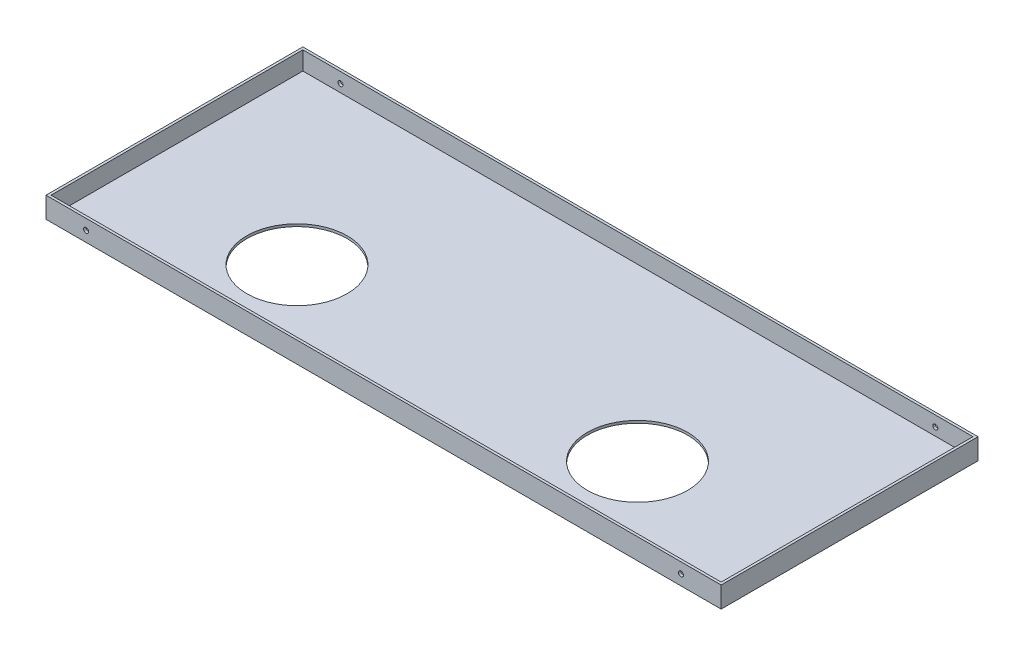
ISO-10303-21;
HEADER;
FILE_DESCRIPTION(('STEP AP214'),'2;1');
FILE_NAME('part.step','',(''),(''),'','','');
FILE_SCHEMA(('AUTOMOTIVE_DESIGN { 1 0 10303 214 1 1 1 1 }'));
ENDSEC;
DATA;
#1=APPLICATION_CONTEXT('core data for automotive mechanical design processes');
#2=APPLICATION_PROTOCOL_DEFINITION('international standard','automotive_design',2000,#1);
#3=PRODUCT_CONTEXT('',#1,'mechanical');
#4=PRODUCT('Part','Part','',(#3));
#5=PRODUCT_RELATED_PRODUCT_CATEGORY('part','',(#4));
#6=PRODUCT_DEFINITION_FORMATION('','',#4);
#7=PRODUCT_DEFINITION_CONTEXT('part definition',#1,'design');
#8=PRODUCT_DEFINITION('design','',#6,#7);
#9=PRODUCT_DEFINITION_SHAPE('','',#8);
#10=(LENGTH_UNIT() NAMED_UNIT(*) SI_UNIT(.MILLI.,.METRE.));
#11=(NAMED_UNIT(*) PLANE_ANGLE_UNIT() SI_UNIT($,.RADIAN.));
#12=(NAMED_UNIT(*) SI_UNIT($,.STERADIAN.) SOLID_ANGLE_UNIT());
#13=UNCERTAINTY_MEASURE_WITH_UNIT(LENGTH_MEASURE(1.E-05),#10,'distance_accuracy_value','');
#14=(GEOMETRIC_REPRESENTATION_CONTEXT(3) GLOBAL_UNCERTAINTY_ASSIGNED_CONTEXT((#13)) GLOBAL_UNIT_ASSIGNED_CONTEXT((#10,
#11,#12)) REPRESENTATION_CONTEXT('',''));
#15=CARTESIAN_POINT('',(0.,0.,0.));
#16=DIRECTION('',(0.,0.,1.));
#17=DIRECTION('',(1.,0.,0.));
#18=AXIS2_PLACEMENT_3D('',#15,#16,#17);
#19=CARTESIAN_POINT('',(807.,25.,0.));
#20=DIRECTION('',(0.,0.,1.));
#21=DIRECTION('',(1.,0.,0.));
#22=AXIS2_PLACEMENT_3D('',#19,#20,#21);
#23=PLANE('',#22);
#24=CARTESIAN_POINT('',(759.,12.5,0.));
#25=DIRECTION('',(0.,0.,1.));
#26=DIRECTION('',(1.,0.,0.));
#27=AXIS2_PLACEMENT_3D('',#24,#25,#26);
#28=CIRCLE('',#27,3.00000000000005);
#29=CARTESIAN_POINT('',(762.,12.5,0.));
#30=VERTEX_POINT('',#29);
#31=EDGE_CURVE('E204',#30,#30,#28,.T.);
#32=ORIENTED_EDGE('',*,*,#31,.T.);
#33=EDGE_LOOP('',(#32));
#34=FACE_BOUND('',#33,.T.);
#35=CARTESIAN_POINT('',(48.,12.5,0.));
#36=DIRECTION('',(0.,0.,1.));
#37=DIRECTION('',(1.,0.,0.));
#38=AXIS2_PLACEMENT_3D('',#35,#36,#37);
#39=CIRCLE('',#38,3.);
#40=CARTESIAN_POINT('',(51.,12.5,0.));
#41=VERTEX_POINT('',#40);
#42=EDGE_CURVE('E234',#41,#41,#39,.T.);
#43=ORIENTED_EDGE('',*,*,#42,.T.);
#44=EDGE_LOOP('',(#43));
#45=FACE_BOUND('',#44,.T.);
#46=DIRECTION('',(-1.,0.,0.));
#47=VECTOR('',#46,1.);
#48=CARTESIAN_POINT('',(807.,0.,0.));
#49=LINE('',#48,#47);
#50=CARTESIAN_POINT('',(807.,0.,0.));
#51=VERTEX_POINT('',#50);
#52=CARTESIAN_POINT('',(0.,0.,0.));
#53=VERTEX_POINT('',#52);
#54=EDGE_CURVE('E163',#51,#53,#49,.T.);
#55=ORIENTED_EDGE('',*,*,#54,.T.);
#56=DIRECTION('',(0.,-1.,0.));
#57=VECTOR('',#56,1.);
#58=CARTESIAN_POINT('',(0.,25.,0.));
#59=LINE('',#58,#57);
#60=CARTESIAN_POINT('',(0.,25.,0.));
#61=VERTEX_POINT('',#60);
#62=EDGE_CURVE('E11',#61,#53,#59,.T.);
#63=ORIENTED_EDGE('',*,*,#62,.F.);
#64=DIRECTION('',(-1.,0.,0.));
#65=VECTOR('',#64,1.);
#66=CARTESIAN_POINT('',(807.,25.,0.));
#67=LINE('',#66,#65);
#68=CARTESIAN_POINT('',(807.,25.,0.));
#69=VERTEX_POINT('',#68);
#70=EDGE_CURVE('E169',#69,#61,#67,.T.);
#71=ORIENTED_EDGE('',*,*,#70,.F.);
#72=DIRECTION('',(0.,-1.,0.));
#73=VECTOR('',#72,1.);
#74=CARTESIAN_POINT('',(807.,25.,0.));
#75=LINE('',#74,#73);
#76=EDGE_CURVE('E179',#69,#51,#75,.T.);
#77=ORIENTED_EDGE('',*,*,#76,.T.);
#78=EDGE_LOOP('',(#55,#63,#71,#77));
#79=FACE_BOUND('',#78,.T.);
#80=ADVANCED_FACE('F39',(#34,#45,#79),#23,.F.);
#81=CARTESIAN_POINT('',(0.,25.,0.));
#82=DIRECTION('',(1.,0.,0.));
#83=DIRECTION('',(0.,0.,-1.));
#84=AXIS2_PLACEMENT_3D('',#81,#82,#83);
#85=PLANE('',#84);
#86=DIRECTION('',(0.,0.,1.));
#87=VECTOR('',#86,1.);
#88=CARTESIAN_POINT('',(0.,0.,0.));
#89=LINE('',#88,#87);
#90=CARTESIAN_POINT('',(0.,0.,307.));
#91=VERTEX_POINT('',#90);
#92=EDGE_CURVE('E183',#53,#91,#89,.T.);
#93=ORIENTED_EDGE('',*,*,#92,.T.);
#94=DIRECTION('',(0.,-1.,0.));
#95=VECTOR('',#94,1.);
#96=CARTESIAN_POINT('',(0.,25.,307.));
#97=LINE('',#96,#95);
#98=CARTESIAN_POINT('',(0.,25.,307.));
#99=VERTEX_POINT('',#98);
#100=EDGE_CURVE('E48',#99,#91,#97,.T.);
#101=ORIENTED_EDGE('',*,*,#100,.F.);
#102=DIRECTION('',(0.,0.,1.));
#103=VECTOR('',#102,1.);
#104=CARTESIAN_POINT('',(0.,25.,0.));
#105=LINE('',#104,#103);
#106=EDGE_CURVE('E93',#61,#99,#105,.T.);
#107=ORIENTED_EDGE('',*,*,#106,.F.);
#108=ORIENTED_EDGE('',*,*,#62,.T.);
#109=EDGE_LOOP('',(#93,#101,#107,#108));
#110=FACE_BOUND('',#109,.T.);
#111=ADVANCED_FACE('F264',(#110),#85,.F.);
#112=CARTESIAN_POINT('',(0.,25.,307.));
#113=DIRECTION('',(0.,0.,-1.));
#114=DIRECTION('',(-1.,0.,0.));
#115=AXIS2_PLACEMENT_3D('',#112,#113,#114);
#116=PLANE('',#115);
#117=CARTESIAN_POINT('',(759.,12.5,307.));
#118=DIRECTION('',(0.,0.,1.));
#119=DIRECTION('',(1.,0.,0.));
#120=AXIS2_PLACEMENT_3D('',#117,#118,#119);
#121=CIRCLE('',#120,3.00000000000005);
#122=CARTESIAN_POINT('',(762.,12.5,307.));
#123=VERTEX_POINT('',#122);
#124=EDGE_CURVE('E230',#123,#123,#121,.T.);
#125=ORIENTED_EDGE('',*,*,#124,.F.);
#126=EDGE_LOOP('',(#125));
#127=FACE_BOUND('',#126,.T.);
#128=CARTESIAN_POINT('',(48.,12.5,307.));
#129=DIRECTION('',(0.,0.,1.));
#130=DIRECTION('',(1.,0.,0.));
#131=AXIS2_PLACEMENT_3D('',#128,#129,#130);
#132=CIRCLE('',#131,3.);
#133=CARTESIAN_POINT('',(51.,12.5,307.));
#134=VERTEX_POINT('',#133);
#135=EDGE_CURVE('E217',#134,#134,#132,.T.);
#136=ORIENTED_EDGE('',*,*,#135,.F.);
#137=EDGE_LOOP('',(#136));
#138=FACE_BOUND('',#137,.T.);
#139=DIRECTION('',(1.,0.,0.));
#140=VECTOR('',#139,1.);
#141=CARTESIAN_POINT('',(0.,0.,307.));
#142=LINE('',#141,#140);
#143=CARTESIAN_POINT('',(807.,0.,307.));
#144=VERTEX_POINT('',#143);
#145=EDGE_CURVE('E186',#91,#144,#142,.T.);
#146=ORIENTED_EDGE('',*,*,#145,.T.);
#147=DIRECTION('',(0.,-1.,0.));
#148=VECTOR('',#147,1.);
#149=CARTESIAN_POINT('',(807.,25.,307.));
#150=LINE('',#149,#148);
#151=CARTESIAN_POINT('',(807.,25.,307.));
#152=VERTEX_POINT('',#151);
#153=EDGE_CURVE('E193',#152,#144,#150,.T.);
#154=ORIENTED_EDGE('',*,*,#153,.F.);
#155=DIRECTION('',(1.,0.,0.));
#156=VECTOR('',#155,1.);
#157=CARTESIAN_POINT('',(0.,25.,307.));
#158=LINE('',#157,#156);
#159=EDGE_CURVE('E174',#99,#152,#158,.T.);
#160=ORIENTED_EDGE('',*,*,#159,.F.);
#161=ORIENTED_EDGE('',*,*,#100,.T.);
#162=EDGE_LOOP('',(#146,#154,#160,#161));
#163=FACE_BOUND('',#162,.T.);
#164=ADVANCED_FACE('F269',(#127,#138,#163),#116,.F.);
#165=CARTESIAN_POINT('',(807.,25.,307.));
#166=DIRECTION('',(-1.,0.,0.));
#167=DIRECTION('',(0.,0.,1.));
#168=AXIS2_PLACEMENT_3D('',#165,#166,#167);
#169=PLANE('',#168);
#170=DIRECTION('',(0.,0.,-1.));
#171=VECTOR('',#170,1.);
#172=CARTESIAN_POINT('',(807.,0.,307.));
#173=LINE('',#172,#171);
#174=EDGE_CURVE('E86',#144,#51,#173,.T.);
#175=ORIENTED_EDGE('',*,*,#174,.T.);
#176=ORIENTED_EDGE('',*,*,#76,.F.);
#177=DIRECTION('',(0.,0.,-1.));
#178=VECTOR('',#177,1.);
#179=CARTESIAN_POINT('',(807.,25.,307.));
#180=LINE('',#179,#178);
#181=EDGE_CURVE('E65',#152,#69,#180,.T.);
#182=ORIENTED_EDGE('',*,*,#181,.F.);
#183=ORIENTED_EDGE('',*,*,#153,.T.);
#184=EDGE_LOOP('',(#175,#176,#182,#183));
#185=FACE_BOUND('',#184,.T.);
#186=ADVANCED_FACE('F285',(#185),#169,.F.);
#187=CARTESIAN_POINT('',(0.,25.,0.));
#188=DIRECTION('',(0.,1.,0.));
#189=DIRECTION('',(0.,0.,1.));
#190=AXIS2_PLACEMENT_3D('',#187,#188,#189);
#191=PLANE('',#190);
#192=DIRECTION('',(1.,0.,0.));
#193=VECTOR('',#192,1.);
#194=CARTESIAN_POINT('',(3.00000000000004,25.,304.));
#195=LINE('',#194,#193);
#196=CARTESIAN_POINT('',(3.00000000000004,25.,304.));
#197=VERTEX_POINT('',#196);
#198=CARTESIAN_POINT('',(804.,25.,304.));
#199=VERTEX_POINT('',#198);
#200=EDGE_CURVE('E56',#197,#199,#195,.T.);
#201=ORIENTED_EDGE('',*,*,#200,.F.);
#202=DIRECTION('',(0.,0.,1.));
#203=VECTOR('',#202,1.);
#204=CARTESIAN_POINT('',(3.,25.,3.));
#205=LINE('',#204,#203);
#206=CARTESIAN_POINT('',(3.,25.,3.));
#207=VERTEX_POINT('',#206);
#208=EDGE_CURVE('E138',#207,#197,#205,.T.);
#209=ORIENTED_EDGE('',*,*,#208,.F.);
#210=DIRECTION('',(-1.,0.,0.));
#211=VECTOR('',#210,1.);
#212=CARTESIAN_POINT('',(804.,25.,3.));
#213=LINE('',#212,#211);
#214=CARTESIAN_POINT('',(804.,25.,3.));
#215=VERTEX_POINT('',#214);
#216=EDGE_CURVE('E142',#215,#207,#213,.T.);
#217=ORIENTED_EDGE('',*,*,#216,.F.);
#218=DIRECTION('',(0.,0.,-1.));
#219=VECTOR('',#218,1.);
#220=CARTESIAN_POINT('',(804.,25.,304.));
#221=LINE('',#220,#219);
#222=EDGE_CURVE('E154',#199,#215,#221,.T.);
#223=ORIENTED_EDGE('',*,*,#222,.F.);
#224=EDGE_LOOP('',(#201,#209,#217,#223));
#225=FACE_BOUND('',#224,.T.);
#226=ORIENTED_EDGE('',*,*,#70,.T.);
#227=ORIENTED_EDGE('',*,*,#106,.T.);
#228=ORIENTED_EDGE('',*,*,#159,.T.);
#229=ORIENTED_EDGE('',*,*,#181,.T.);
#230=EDGE_LOOP('',(#226,#227,#228,#229));
#231=FACE_BOUND('',#230,.T.);
#232=ADVANCED_FACE('F283',(#225,#231),#191,.T.);
#233=CARTESIAN_POINT('',(0.,0.,0.));
#234=DIRECTION('',(0.,1.,0.));
#235=DIRECTION('',(0.,0.,1.));
#236=AXIS2_PLACEMENT_3D('',#233,#234,#235);
#237=PLANE('',#236);
#238=CARTESIAN_POINT('',(607.,0.,207.));
#239=DIRECTION('',(0.,-1.,0.));
#240=DIRECTION('',(0.,0.,-1.));
#241=AXIS2_PLACEMENT_3D('',#238,#239,#240);
#242=CIRCLE('',#241,60.);
#243=CARTESIAN_POINT('',(607.,0.,147.));
#244=VERTEX_POINT('',#243);
#245=EDGE_CURVE('E211',#244,#244,#242,.T.);
#246=ORIENTED_EDGE('',*,*,#245,.F.);
#247=EDGE_LOOP('',(#246));
#248=FACE_BOUND('',#247,.T.);
#249=CARTESIAN_POINT('',(200.,0.,207.));
#250=DIRECTION('',(0.,-1.,0.));
#251=DIRECTION('',(0.,0.,-1.));
#252=AXIS2_PLACEMENT_3D('',#249,#250,#251);
#253=CIRCLE('',#252,60.);
#254=CARTESIAN_POINT('',(200.,0.,147.));
#255=VERTEX_POINT('',#254);
#256=EDGE_CURVE('E219',#255,#255,#253,.T.);
#257=ORIENTED_EDGE('',*,*,#256,.F.);
#258=EDGE_LOOP('',(#257));
#259=FACE_BOUND('',#258,.T.);
#260=ORIENTED_EDGE('',*,*,#54,.F.);
#261=ORIENTED_EDGE('',*,*,#174,.F.);
#262=ORIENTED_EDGE('',*,*,#145,.F.);
#263=ORIENTED_EDGE('',*,*,#92,.F.);
#264=EDGE_LOOP('',(#260,#261,#262,#263));
#265=FACE_BOUND('',#264,.T.);
#266=ADVANCED_FACE('F278',(#248,#259,#265),#237,.F.);
#267=CARTESIAN_POINT('',(3.00000000000004,3.,304.));
#268=DIRECTION('',(0.,0.,1.));
#269=DIRECTION('',(1.,0.,0.));
#270=AXIS2_PLACEMENT_3D('',#267,#268,#269);
#271=PLANE('',#270);
#272=CARTESIAN_POINT('',(759.,12.5,304.));
#273=DIRECTION('',(0.,0.,1.));
#274=DIRECTION('',(1.,0.,0.));
#275=AXIS2_PLACEMENT_3D('',#272,#273,#274);
#276=CIRCLE('',#275,3.00000000000005);
#277=CARTESIAN_POINT('',(762.,12.5,304.));
#278=VERTEX_POINT('',#277);
#279=EDGE_CURVE('E145',#278,#278,#276,.T.);
#280=ORIENTED_EDGE('',*,*,#279,.T.);
#281=EDGE_LOOP('',(#280));
#282=FACE_BOUND('',#281,.T.);
#283=CARTESIAN_POINT('',(48.,12.5,304.));
#284=DIRECTION('',(0.,0.,1.));
#285=DIRECTION('',(1.,0.,0.));
#286=AXIS2_PLACEMENT_3D('',#283,#284,#285);
#287=CIRCLE('',#286,3.);
#288=CARTESIAN_POINT('',(51.,12.5,304.));
#289=VERTEX_POINT('',#288);
#290=EDGE_CURVE('E203',#289,#289,#287,.T.);
#291=ORIENTED_EDGE('',*,*,#290,.T.);
#292=EDGE_LOOP('',(#291));
#293=FACE_BOUND('',#292,.T.);
#294=ORIENTED_EDGE('',*,*,#200,.T.);
#295=DIRECTION('',(0.,1.,0.));
#296=VECTOR('',#295,1.);
#297=CARTESIAN_POINT('',(804.,3.,304.));
#298=LINE('',#297,#296);
#299=CARTESIAN_POINT('',(804.,3.,304.));
#300=VERTEX_POINT('',#299);
#301=EDGE_CURVE('E113',#300,#199,#298,.T.);
#302=ORIENTED_EDGE('',*,*,#301,.F.);
#303=DIRECTION('',(1.,0.,0.));
#304=VECTOR('',#303,1.);
#305=CARTESIAN_POINT('',(3.00000000000004,3.,304.));
#306=LINE('',#305,#304);
#307=CARTESIAN_POINT('',(3.00000000000004,3.,304.));
#308=VERTEX_POINT('',#307);
#309=EDGE_CURVE('E117',#308,#300,#306,.T.);
#310=ORIENTED_EDGE('',*,*,#309,.F.);
#311=DIRECTION('',(0.,1.,0.));
#312=VECTOR('',#311,1.);
#313=CARTESIAN_POINT('',(3.00000000000004,3.,304.));
#314=LINE('',#313,#312);
#315=EDGE_CURVE('E160',#308,#197,#314,.T.);
#316=ORIENTED_EDGE('',*,*,#315,.T.);
#317=EDGE_LOOP('',(#294,#302,#310,#316));
#318=FACE_BOUND('',#317,.T.);
#319=ADVANCED_FACE('F115',(#282,#293,#318),#271,.F.);
#320=CARTESIAN_POINT('',(3.,3.,3.));
#321=DIRECTION('',(-1.,0.,0.));
#322=DIRECTION('',(0.,0.,1.));
#323=AXIS2_PLACEMENT_3D('',#320,#321,#322);
#324=PLANE('',#323);
#325=ORIENTED_EDGE('',*,*,#208,.T.);
#326=ORIENTED_EDGE('',*,*,#315,.F.);
#327=DIRECTION('',(0.,0.,1.));
#328=VECTOR('',#327,1.);
#329=CARTESIAN_POINT('',(3.,3.,3.));
#330=LINE('',#329,#328);
#331=CARTESIAN_POINT('',(3.,3.,3.));
#332=VERTEX_POINT('',#331);
#333=EDGE_CURVE('E124',#332,#308,#330,.T.);
#334=ORIENTED_EDGE('',*,*,#333,.F.);
#335=DIRECTION('',(0.,1.,0.));
#336=VECTOR('',#335,1.);
#337=CARTESIAN_POINT('',(3.,3.,3.));
#338=LINE('',#337,#336);
#339=EDGE_CURVE('E164',#332,#207,#338,.T.);
#340=ORIENTED_EDGE('',*,*,#339,.T.);
#341=EDGE_LOOP('',(#325,#326,#334,#340));
#342=FACE_BOUND('',#341,.T.);
#343=ADVANCED_FACE('F311',(#342),#324,.F.);
#344=CARTESIAN_POINT('',(804.,3.,3.));
#345=DIRECTION('',(0.,0.,-1.));
#346=DIRECTION('',(-1.,0.,0.));
#347=AXIS2_PLACEMENT_3D('',#344,#345,#346);
#348=PLANE('',#347);
#349=CARTESIAN_POINT('',(759.,12.5,3.));
#350=DIRECTION('',(0.,0.,-1.));
#351=DIRECTION('',(-1.,0.,0.));
#352=AXIS2_PLACEMENT_3D('',#349,#350,#351);
#353=CIRCLE('',#352,3.00000000000005);
#354=CARTESIAN_POINT('',(756.,12.5,3.));
#355=VERTEX_POINT('',#354);
#356=EDGE_CURVE('E205',#355,#355,#353,.T.);
#357=ORIENTED_EDGE('',*,*,#356,.T.);
#358=EDGE_LOOP('',(#357));
#359=FACE_BOUND('',#358,.T.);
#360=CARTESIAN_POINT('',(48.,12.5,3.));
#361=DIRECTION('',(0.,0.,-1.));
#362=DIRECTION('',(-1.,0.,0.));
#363=AXIS2_PLACEMENT_3D('',#360,#361,#362);
#364=CIRCLE('',#363,3.);
#365=CARTESIAN_POINT('',(45.,12.5,3.));
#366=VERTEX_POINT('',#365);
#367=EDGE_CURVE('E199',#366,#366,#364,.T.);
#368=ORIENTED_EDGE('',*,*,#367,.T.);
#369=EDGE_LOOP('',(#368));
#370=FACE_BOUND('',#369,.T.);
#371=ORIENTED_EDGE('',*,*,#216,.T.);
#372=ORIENTED_EDGE('',*,*,#339,.F.);
#373=DIRECTION('',(-1.,0.,0.));
#374=VECTOR('',#373,1.);
#375=CARTESIAN_POINT('',(804.,3.,3.));
#376=LINE('',#375,#374);
#377=CARTESIAN_POINT('',(804.,3.,3.));
#378=VERTEX_POINT('',#377);
#379=EDGE_CURVE('E133',#378,#332,#376,.T.);
#380=ORIENTED_EDGE('',*,*,#379,.F.);
#381=DIRECTION('',(0.,1.,0.));
#382=VECTOR('',#381,1.);
#383=CARTESIAN_POINT('',(804.,3.,3.));
#384=LINE('',#383,#382);
#385=EDGE_CURVE('E123',#378,#215,#384,.T.);
#386=ORIENTED_EDGE('',*,*,#385,.T.);
#387=EDGE_LOOP('',(#371,#372,#380,#386));
#388=FACE_BOUND('',#387,.T.);
#389=ADVANCED_FACE('F315',(#359,#370,#388),#348,.F.);
#390=CARTESIAN_POINT('',(804.,3.,304.));
#391=DIRECTION('',(1.,0.,0.));
#392=DIRECTION('',(0.,0.,-1.));
#393=AXIS2_PLACEMENT_3D('',#390,#391,#392);
#394=PLANE('',#393);
#395=ORIENTED_EDGE('',*,*,#222,.T.);
#396=ORIENTED_EDGE('',*,*,#385,.F.);
#397=DIRECTION('',(0.,0.,-1.));
#398=VECTOR('',#397,1.);
#399=CARTESIAN_POINT('',(804.,3.,304.));
#400=LINE('',#399,#398);
#401=EDGE_CURVE('E127',#300,#378,#400,.T.);
#402=ORIENTED_EDGE('',*,*,#401,.F.);
#403=ORIENTED_EDGE('',*,*,#301,.T.);
#404=EDGE_LOOP('',(#395,#396,#402,#403));
#405=FACE_BOUND('',#404,.T.);
#406=ADVANCED_FACE('F128',(#405),#394,.F.);
#407=CARTESIAN_POINT('',(0.,3.,0.));
#408=DIRECTION('',(0.,1.,0.));
#409=DIRECTION('',(0.,0.,1.));
#410=AXIS2_PLACEMENT_3D('',#407,#408,#409);
#411=PLANE('',#410);
#412=CARTESIAN_POINT('',(607.,3.,207.));
#413=DIRECTION('',(0.,1.,0.));
#414=DIRECTION('',(0.,0.,1.));
#415=AXIS2_PLACEMENT_3D('',#412,#413,#414);
#416=CIRCLE('',#415,60.);
#417=CARTESIAN_POINT('',(607.,3.,267.));
#418=VERTEX_POINT('',#417);
#419=EDGE_CURVE('E42',#418,#418,#416,.T.);
#420=ORIENTED_EDGE('',*,*,#419,.F.);
#421=EDGE_LOOP('',(#420));
#422=FACE_BOUND('',#421,.T.);
#423=CARTESIAN_POINT('',(200.,3.,207.));
#424=DIRECTION('',(0.,1.,0.));
#425=DIRECTION('',(0.,0.,1.));
#426=AXIS2_PLACEMENT_3D('',#423,#424,#425);
#427=CIRCLE('',#426,60.);
#428=CARTESIAN_POINT('',(200.,3.,267.));
#429=VERTEX_POINT('',#428);
#430=EDGE_CURVE('E208',#429,#429,#427,.T.);
#431=ORIENTED_EDGE('',*,*,#430,.F.);
#432=EDGE_LOOP('',(#431));
#433=FACE_BOUND('',#432,.T.);
#434=ORIENTED_EDGE('',*,*,#309,.T.);
#435=ORIENTED_EDGE('',*,*,#401,.T.);
#436=ORIENTED_EDGE('',*,*,#379,.T.);
#437=ORIENTED_EDGE('',*,*,#333,.T.);
#438=EDGE_LOOP('',(#434,#435,#436,#437));
#439=FACE_BOUND('',#438,.T.);
#440=ADVANCED_FACE('F135',(#422,#433,#439),#411,.T.);
#441=CARTESIAN_POINT('',(48.,12.5,0.));
#442=DIRECTION('',(0.,0.,1.));
#443=DIRECTION('',(1.,0.,0.));
#444=AXIS2_PLACEMENT_3D('',#441,#442,#443);
#445=CYLINDRICAL_SURFACE('',#444,3.);
#446=ORIENTED_EDGE('',*,*,#42,.F.);
#447=EDGE_LOOP('',(#446));
#448=FACE_BOUND('',#447,.T.);
#449=ORIENTED_EDGE('',*,*,#367,.F.);
#450=EDGE_LOOP('',(#449));
#451=FACE_BOUND('',#450,.T.);
#452=ADVANCED_FACE('F251',(#448,#451),#445,.F.);
#453=CARTESIAN_POINT('',(759.,12.5,0.));
#454=DIRECTION('',(0.,0.,1.));
#455=DIRECTION('',(1.,0.,0.));
#456=AXIS2_PLACEMENT_3D('',#453,#454,#455);
#457=CYLINDRICAL_SURFACE('',#456,3.00000000000005);
#458=ORIENTED_EDGE('',*,*,#31,.F.);
#459=EDGE_LOOP('',(#458));
#460=FACE_BOUND('',#459,.T.);
#461=ORIENTED_EDGE('',*,*,#356,.F.);
#462=EDGE_LOOP('',(#461));
#463=FACE_BOUND('',#462,.T.);
#464=ADVANCED_FACE('F248',(#460,#463),#457,.F.);
#465=ORIENTED_EDGE('',*,*,#135,.T.);
#466=EDGE_LOOP('',(#465));
#467=FACE_BOUND('',#466,.T.);
#468=ORIENTED_EDGE('',*,*,#290,.F.);
#469=EDGE_LOOP('',(#468));
#470=FACE_BOUND('',#469,.T.);
#471=ADVANCED_FACE('F245',(#467,#470),#445,.F.);
#472=ORIENTED_EDGE('',*,*,#124,.T.);
#473=EDGE_LOOP('',(#472));
#474=FACE_BOUND('',#473,.T.);
#475=ORIENTED_EDGE('',*,*,#279,.F.);
#476=EDGE_LOOP('',(#475));
#477=FACE_BOUND('',#476,.T.);
#478=ADVANCED_FACE('F247',(#474,#477),#457,.F.);
#479=CARTESIAN_POINT('',(200.,25.,207.));
#480=DIRECTION('',(0.,-1.,0.));
#481=DIRECTION('',(0.,0.,-1.));
#482=AXIS2_PLACEMENT_3D('',#479,#480,#481);
#483=CYLINDRICAL_SURFACE('',#482,60.);
#484=ORIENTED_EDGE('',*,*,#430,.T.);
#485=EDGE_LOOP('',(#484));
#486=FACE_BOUND('',#485,.T.);
#487=ORIENTED_EDGE('',*,*,#256,.T.);
#488=EDGE_LOOP('',(#487));
#489=FACE_BOUND('',#488,.T.);
#490=ADVANCED_FACE('F256',(#486,#489),#483,.F.);
#491=CARTESIAN_POINT('',(607.,25.,207.));
#492=DIRECTION('',(0.,-1.,0.));
#493=DIRECTION('',(0.,0.,-1.));
#494=AXIS2_PLACEMENT_3D('',#491,#492,#493);
#495=CYLINDRICAL_SURFACE('',#494,60.);
#496=ORIENTED_EDGE('',*,*,#419,.T.);
#497=EDGE_LOOP('',(#496));
#498=FACE_BOUND('',#497,.T.);
#499=ORIENTED_EDGE('',*,*,#245,.T.);
#500=EDGE_LOOP('',(#499));
#501=FACE_BOUND('',#500,.T.);
#502=ADVANCED_FACE('F333',(#498,#501),#495,.F.);
#503=CLOSED_SHELL('',(#80,#111,#164,#186,#232,#266,#319,#343,#389,#406,#440,#452,#464,#471,#478,
#490,#502));
#504=MANIFOLD_SOLID_BREP('B2',#503);
#505=ADVANCED_BREP_SHAPE_REPRESENTATION('',(#18,#504),#14);
#506=SHAPE_DEFINITION_REPRESENTATION(#9,#505);
ENDSEC;
END-ISO-10303-21;
